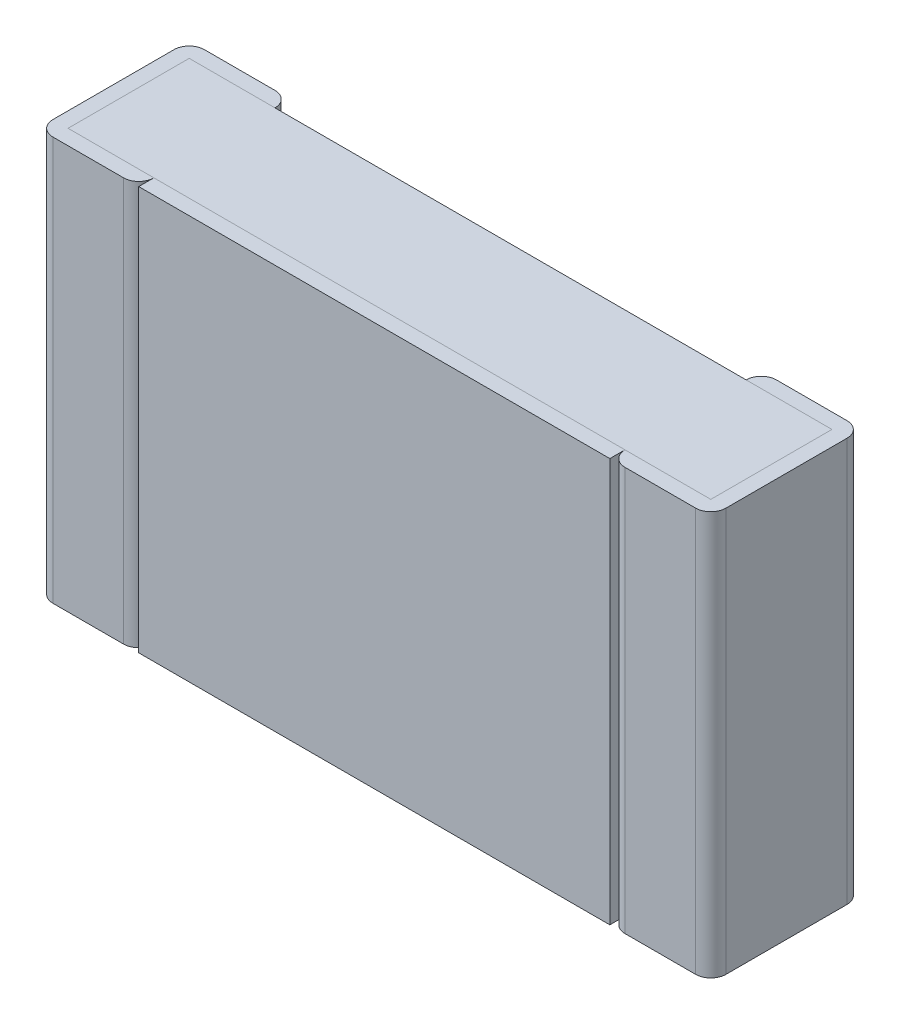
ISO-10303-21;
HEADER;
FILE_DESCRIPTION(('STEP AP214'),'2;1');
FILE_NAME('part.step','',(''),(''),'','','');
FILE_SCHEMA(('AUTOMOTIVE_DESIGN { 1 0 10303 214 1 1 1 1 }'));
ENDSEC;
DATA;
#1=APPLICATION_CONTEXT('core data for automotive mechanical design processes');
#2=APPLICATION_PROTOCOL_DEFINITION('international standard','automotive_design',2000,#1);
#3=PRODUCT_CONTEXT('',#1,'mechanical');
#4=PRODUCT('Part','Part','',(#3));
#5=PRODUCT_RELATED_PRODUCT_CATEGORY('part','',(#4));
#6=PRODUCT_DEFINITION_FORMATION('','',#4);
#7=PRODUCT_DEFINITION_CONTEXT('part definition',#1,'design');
#8=PRODUCT_DEFINITION('design','',#6,#7);
#9=PRODUCT_DEFINITION_SHAPE('','',#8);
#10=(LENGTH_UNIT() NAMED_UNIT(*) SI_UNIT(.MILLI.,.METRE.));
#11=(NAMED_UNIT(*) PLANE_ANGLE_UNIT() SI_UNIT($,.RADIAN.));
#12=(NAMED_UNIT(*) SI_UNIT($,.STERADIAN.) SOLID_ANGLE_UNIT());
#13=UNCERTAINTY_MEASURE_WITH_UNIT(LENGTH_MEASURE(1.E-05),#10,'distance_accuracy_value','');
#14=(GEOMETRIC_REPRESENTATION_CONTEXT(3) GLOBAL_UNCERTAINTY_ASSIGNED_CONTEXT((#13)) GLOBAL_UNIT_ASSIGNED_CONTEXT((#10,
#11,#12)) REPRESENTATION_CONTEXT('',''));
#15=CARTESIAN_POINT('',(0.,0.,0.));
#16=DIRECTION('',(0.,0.,1.));
#17=DIRECTION('',(1.,0.,0.));
#18=AXIS2_PLACEMENT_3D('',#15,#16,#17);
#19=CARTESIAN_POINT('',(-1.,-0.6,0.));
#20=DIRECTION('',(1.,0.,0.));
#21=DIRECTION('',(0.,1.,0.));
#22=AXIS2_PLACEMENT_3D('',#19,#20,#21);
#23=PLANE('',#22);
#24=DIRECTION('',(0.,1.,0.));
#25=VECTOR('',#24,1.);
#26=CARTESIAN_POINT('',(-1.,-0.6,0.405));
#27=LINE('',#26,#25);
#28=CARTESIAN_POINT('',(-1.,-0.6,0.405));
#29=VERTEX_POINT('',#28);
#30=CARTESIAN_POINT('',(-1.,0.6,0.405));
#31=VERTEX_POINT('',#30);
#32=EDGE_CURVE('E11',#29,#31,#27,.T.);
#33=ORIENTED_EDGE('',*,*,#32,.T.);
#34=DIRECTION('',(0.,0.,1.));
#35=VECTOR('',#34,1.);
#36=CARTESIAN_POINT('',(-1.,0.6,0.));
#37=LINE('',#36,#35);
#38=CARTESIAN_POINT('',(-1.,0.6,0.045));
#39=VERTEX_POINT('',#38);
#40=EDGE_CURVE('E41',#39,#31,#37,.T.);
#41=ORIENTED_EDGE('',*,*,#40,.F.);
#42=DIRECTION('',(0.,1.,0.));
#43=VECTOR('',#42,1.);
#44=CARTESIAN_POINT('',(-1.,-0.6,0.045));
#45=LINE('',#44,#43);
#46=CARTESIAN_POINT('',(-1.,-0.6,0.045));
#47=VERTEX_POINT('',#46);
#48=EDGE_CURVE('E225',#47,#39,#45,.T.);
#49=ORIENTED_EDGE('',*,*,#48,.F.);
#50=DIRECTION('',(0.,0.,1.));
#51=VECTOR('',#50,1.);
#52=CARTESIAN_POINT('',(-1.,-0.6,0.));
#53=LINE('',#52,#51);
#54=EDGE_CURVE('E27',#47,#29,#53,.T.);
#55=ORIENTED_EDGE('',*,*,#54,.T.);
#56=EDGE_LOOP('',(#33,#41,#49,#55));
#57=FACE_BOUND('',#56,.T.);
#58=ADVANCED_FACE('F16',(#57),#23,.F.);
#59=CARTESIAN_POINT('',(-1.,-0.6,0.));
#60=DIRECTION('',(0.,1.,0.));
#61=DIRECTION('',(1.,0.,0.));
#62=AXIS2_PLACEMENT_3D('',#59,#60,#61);
#63=PLANE('',#62);
#64=CARTESIAN_POINT('',(-0.745,-0.6,0.045));
#65=DIRECTION('',(0.,1.,0.));
#66=DIRECTION('',(0.,0.,1.));
#67=AXIS2_PLACEMENT_3D('',#64,#65,#66);
#68=CIRCLE('',#67,0.045);
#69=CARTESIAN_POINT('',(-0.7,-0.6,0.045));
#70=VERTEX_POINT('',#69);
#71=CARTESIAN_POINT('',(-0.745,-0.6,0.));
#72=VERTEX_POINT('',#71);
#73=EDGE_CURVE('E316',#70,#72,#68,.T.);
#74=ORIENTED_EDGE('',*,*,#73,.F.);
#75=DIRECTION('',(1.,0.,0.));
#76=VECTOR('',#75,1.);
#77=CARTESIAN_POINT('',(-0.955,-0.6,0.045));
#78=LINE('',#77,#76);
#79=CARTESIAN_POINT('',(-0.955,-0.6,0.045));
#80=VERTEX_POINT('',#79);
#81=EDGE_CURVE('E205',#80,#70,#78,.T.);
#82=ORIENTED_EDGE('',*,*,#81,.F.);
#83=DIRECTION('',(0.,0.,1.));
#84=VECTOR('',#83,1.);
#85=CARTESIAN_POINT('',(-0.955,-0.6,0.045));
#86=LINE('',#85,#84);
#87=CARTESIAN_POINT('',(-0.955,-0.6,0.405));
#88=VERTEX_POINT('',#87);
#89=EDGE_CURVE('E189',#80,#88,#86,.T.);
#90=ORIENTED_EDGE('',*,*,#89,.T.);
#91=DIRECTION('',(1.,0.,0.));
#92=VECTOR('',#91,1.);
#93=CARTESIAN_POINT('',(-0.955,-0.6,0.405));
#94=LINE('',#93,#92);
#95=CARTESIAN_POINT('',(-0.7,-0.6,0.405));
#96=VERTEX_POINT('',#95);
#97=EDGE_CURVE('E315',#88,#96,#94,.T.);
#98=ORIENTED_EDGE('',*,*,#97,.T.);
#99=CARTESIAN_POINT('',(-0.745,-0.6,0.405));
#100=DIRECTION('',(0.,-1.,0.));
#101=DIRECTION('',(0.,0.,1.));
#102=AXIS2_PLACEMENT_3D('',#99,#100,#101);
#103=CIRCLE('',#102,0.045);
#104=CARTESIAN_POINT('',(-0.745,-0.6,0.45));
#105=VERTEX_POINT('',#104);
#106=EDGE_CURVE('E194',#96,#105,#103,.T.);
#107=ORIENTED_EDGE('',*,*,#106,.T.);
#108=DIRECTION('',(1.,0.,0.));
#109=VECTOR('',#108,1.);
#110=CARTESIAN_POINT('',(-1.,-0.6,0.45));
#111=LINE('',#110,#109);
#112=CARTESIAN_POINT('',(-0.955,-0.6,0.45));
#113=VERTEX_POINT('',#112);
#114=EDGE_CURVE('E209',#113,#105,#111,.T.);
#115=ORIENTED_EDGE('',*,*,#114,.F.);
#116=CARTESIAN_POINT('',(-0.955,-0.6,0.405));
#117=DIRECTION('',(0.,1.,0.));
#118=DIRECTION('',(0.,0.,1.));
#119=AXIS2_PLACEMENT_3D('',#116,#117,#118);
#120=CIRCLE('',#119,0.045);
#121=EDGE_CURVE('E173',#29,#113,#120,.T.);
#122=ORIENTED_EDGE('',*,*,#121,.F.);
#123=ORIENTED_EDGE('',*,*,#54,.F.);
#124=CARTESIAN_POINT('',(-0.955,-0.6,0.045));
#125=DIRECTION('',(0.,-1.,0.));
#126=DIRECTION('',(0.,0.,1.));
#127=AXIS2_PLACEMENT_3D('',#124,#125,#126);
#128=CIRCLE('',#127,0.045);
#129=CARTESIAN_POINT('',(-0.955,-0.6,0.));
#130=VERTEX_POINT('',#129);
#131=EDGE_CURVE('E190',#47,#130,#128,.T.);
#132=ORIENTED_EDGE('',*,*,#131,.T.);
#133=DIRECTION('',(1.,0.,0.));
#134=VECTOR('',#133,1.);
#135=CARTESIAN_POINT('',(-1.,-0.6,0.));
#136=LINE('',#135,#134);
#137=EDGE_CURVE('E195',#130,#72,#136,.T.);
#138=ORIENTED_EDGE('',*,*,#137,.T.);
#139=EDGE_LOOP('',(#74,#82,#90,#98,#107,#115,#122,#123,#132,#138));
#140=FACE_BOUND('',#139,.T.);
#141=ADVANCED_FACE('F18',(#140),#63,.F.);
#142=CARTESIAN_POINT('',(-0.955,-0.6,0.045));
#143=DIRECTION('',(0.,1.,0.));
#144=DIRECTION('',(-1.,0.,0.));
#145=AXIS2_PLACEMENT_3D('',#142,#143,#144);
#146=CYLINDRICAL_SURFACE('',#145,0.045);
#147=ORIENTED_EDGE('',*,*,#48,.T.);
#148=CARTESIAN_POINT('',(-0.955,0.6,0.045));
#149=DIRECTION('',(0.,-1.,0.));
#150=DIRECTION('',(0.,0.,1.));
#151=AXIS2_PLACEMENT_3D('',#148,#149,#150);
#152=CIRCLE('',#151,0.045);
#153=CARTESIAN_POINT('',(-0.955,0.6,0.));
#154=VERTEX_POINT('',#153);
#155=EDGE_CURVE('E218',#39,#154,#152,.T.);
#156=ORIENTED_EDGE('',*,*,#155,.T.);
#157=DIRECTION('',(0.,1.,0.));
#158=VECTOR('',#157,1.);
#159=CARTESIAN_POINT('',(-0.955,-0.6,0.));
#160=LINE('',#159,#158);
#161=EDGE_CURVE('E341',#130,#154,#160,.T.);
#162=ORIENTED_EDGE('',*,*,#161,.F.);
#163=ORIENTED_EDGE('',*,*,#131,.F.);
#164=EDGE_LOOP('',(#147,#156,#162,#163));
#165=FACE_BOUND('',#164,.T.);
#166=ADVANCED_FACE('F526',(#165),#146,.T.);
#167=CARTESIAN_POINT('',(-0.955,-0.6,0.405));
#168=DIRECTION('',(0.,1.,0.));
#169=DIRECTION('',(-1.,0.,0.));
#170=AXIS2_PLACEMENT_3D('',#167,#168,#169);
#171=CYLINDRICAL_SURFACE('',#170,0.045);
#172=ORIENTED_EDGE('',*,*,#121,.T.);
#173=DIRECTION('',(0.,1.,0.));
#174=VECTOR('',#173,1.);
#175=CARTESIAN_POINT('',(-0.955,-0.6,0.45));
#176=LINE('',#175,#174);
#177=CARTESIAN_POINT('',(-0.955,0.6,0.45));
#178=VERTEX_POINT('',#177);
#179=EDGE_CURVE('E169',#113,#178,#176,.T.);
#180=ORIENTED_EDGE('',*,*,#179,.T.);
#181=CARTESIAN_POINT('',(-0.955,0.6,0.405));
#182=DIRECTION('',(0.,1.,0.));
#183=DIRECTION('',(0.,0.,1.));
#184=AXIS2_PLACEMENT_3D('',#181,#182,#183);
#185=CIRCLE('',#184,0.045);
#186=EDGE_CURVE('E166',#31,#178,#185,.T.);
#187=ORIENTED_EDGE('',*,*,#186,.F.);
#188=ORIENTED_EDGE('',*,*,#32,.F.);
#189=EDGE_LOOP('',(#172,#180,#187,#188));
#190=FACE_BOUND('',#189,.T.);
#191=ADVANCED_FACE('F516',(#190),#171,.T.);
#192=CARTESIAN_POINT('',(-1.,0.6,0.));
#193=DIRECTION('',(0.,1.,0.));
#194=DIRECTION('',(1.,0.,0.));
#195=AXIS2_PLACEMENT_3D('',#192,#193,#194);
#196=PLANE('',#195);
#197=DIRECTION('',(1.,0.,0.));
#198=VECTOR('',#197,1.);
#199=CARTESIAN_POINT('',(-1.,0.6,0.));
#200=LINE('',#199,#198);
#201=CARTESIAN_POINT('',(-0.745,0.6,0.));
#202=VERTEX_POINT('',#201);
#203=EDGE_CURVE('E318',#154,#202,#200,.T.);
#204=ORIENTED_EDGE('',*,*,#203,.F.);
#205=ORIENTED_EDGE('',*,*,#155,.F.);
#206=ORIENTED_EDGE('',*,*,#40,.T.);
#207=ORIENTED_EDGE('',*,*,#186,.T.);
#208=DIRECTION('',(1.,0.,0.));
#209=VECTOR('',#208,1.);
#210=CARTESIAN_POINT('',(-1.,0.6,0.45));
#211=LINE('',#210,#209);
#212=CARTESIAN_POINT('',(-0.745,0.6,0.45));
#213=VERTEX_POINT('',#212);
#214=EDGE_CURVE('E168',#178,#213,#211,.T.);
#215=ORIENTED_EDGE('',*,*,#214,.T.);
#216=CARTESIAN_POINT('',(-0.745,0.6,0.405));
#217=DIRECTION('',(0.,-1.,0.));
#218=DIRECTION('',(0.,0.,1.));
#219=AXIS2_PLACEMENT_3D('',#216,#217,#218);
#220=CIRCLE('',#219,0.045);
#221=CARTESIAN_POINT('',(-0.7,0.6,0.405));
#222=VERTEX_POINT('',#221);
#223=EDGE_CURVE('E263',#222,#213,#220,.T.);
#224=ORIENTED_EDGE('',*,*,#223,.F.);
#225=DIRECTION('',(1.,0.,0.));
#226=VECTOR('',#225,1.);
#227=CARTESIAN_POINT('',(-0.955,0.6,0.405));
#228=LINE('',#227,#226);
#229=CARTESIAN_POINT('',(-0.955,0.6,0.405));
#230=VERTEX_POINT('',#229);
#231=EDGE_CURVE('E255',#230,#222,#228,.T.);
#232=ORIENTED_EDGE('',*,*,#231,.F.);
#233=DIRECTION('',(0.,0.,1.));
#234=VECTOR('',#233,1.);
#235=CARTESIAN_POINT('',(-0.955,0.6,0.045));
#236=LINE('',#235,#234);
#237=CARTESIAN_POINT('',(-0.955,0.6,0.045));
#238=VERTEX_POINT('',#237);
#239=EDGE_CURVE('E259',#238,#230,#236,.T.);
#240=ORIENTED_EDGE('',*,*,#239,.F.);
#241=DIRECTION('',(1.,0.,0.));
#242=VECTOR('',#241,1.);
#243=CARTESIAN_POINT('',(-0.955,0.6,0.045));
#244=LINE('',#243,#242);
#245=CARTESIAN_POINT('',(-0.7,0.6,0.045));
#246=VERTEX_POINT('',#245);
#247=EDGE_CURVE('E254',#238,#246,#244,.T.);
#248=ORIENTED_EDGE('',*,*,#247,.T.);
#249=CARTESIAN_POINT('',(-0.745,0.6,0.045));
#250=DIRECTION('',(0.,1.,0.));
#251=DIRECTION('',(0.,0.,1.));
#252=AXIS2_PLACEMENT_3D('',#249,#250,#251);
#253=CIRCLE('',#252,0.045);
#254=EDGE_CURVE('E345',#246,#202,#253,.T.);
#255=ORIENTED_EDGE('',*,*,#254,.T.);
#256=EDGE_LOOP('',(#204,#205,#206,#207,#215,#224,#232,#240,#248,#255));
#257=FACE_BOUND('',#256,.T.);
#258=ADVANCED_FACE('F489',(#257),#196,.T.);
#259=CARTESIAN_POINT('',(-1.,-0.6,0.));
#260=DIRECTION('',(0.,0.,1.));
#261=DIRECTION('',(1.,0.,0.));
#262=AXIS2_PLACEMENT_3D('',#259,#260,#261);
#263=PLANE('',#262);
#264=DIRECTION('',(0.,1.,0.));
#265=VECTOR('',#264,1.);
#266=CARTESIAN_POINT('',(-0.745,-0.6,0.));
#267=LINE('',#266,#265);
#268=EDGE_CURVE('E319',#72,#202,#267,.T.);
#269=ORIENTED_EDGE('',*,*,#268,.F.);
#270=ORIENTED_EDGE('',*,*,#137,.F.);
#271=ORIENTED_EDGE('',*,*,#161,.T.);
#272=ORIENTED_EDGE('',*,*,#203,.T.);
#273=EDGE_LOOP('',(#269,#270,#271,#272));
#274=FACE_BOUND('',#273,.T.);
#275=ADVANCED_FACE('F506',(#274),#263,.F.);
#276=CARTESIAN_POINT('',(-0.745,-0.6,0.045));
#277=DIRECTION('',(0.,1.,0.));
#278=DIRECTION('',(1.,0.,0.));
#279=AXIS2_PLACEMENT_3D('',#276,#277,#278);
#280=CYLINDRICAL_SURFACE('',#279,0.045);
#281=ORIENTED_EDGE('',*,*,#73,.T.);
#282=ORIENTED_EDGE('',*,*,#268,.T.);
#283=ORIENTED_EDGE('',*,*,#254,.F.);
#284=DIRECTION('',(0.,1.,0.));
#285=VECTOR('',#284,1.);
#286=CARTESIAN_POINT('',(-0.7,-0.6,0.045));
#287=LINE('',#286,#285);
#288=EDGE_CURVE('E174',#70,#246,#287,.T.);
#289=ORIENTED_EDGE('',*,*,#288,.F.);
#290=EDGE_LOOP('',(#281,#282,#283,#289));
#291=FACE_BOUND('',#290,.T.);
#292=ADVANCED_FACE('F488',(#291),#280,.T.);
#293=CARTESIAN_POINT('',(-0.955,-0.6,0.045));
#294=DIRECTION('',(0.,1.,0.));
#295=DIRECTION('',(1.,0.,0.));
#296=AXIS2_PLACEMENT_3D('',#293,#294,#295);
#297=PLANE('',#296);
#298=DIRECTION('',(1.,0.,0.));
#299=VECTOR('',#298,1.);
#300=CARTESIAN_POINT('',(-0.955,-0.6,0.045));
#301=LINE('',#300,#299);
#302=CARTESIAN_POINT('',(0.7,-0.6,0.045));
#303=VERTEX_POINT('',#302);
#304=EDGE_CURVE('E184',#70,#303,#301,.T.);
#305=ORIENTED_EDGE('',*,*,#304,.T.);
#306=DIRECTION('',(1.,0.,0.));
#307=VECTOR('',#306,1.);
#308=CARTESIAN_POINT('',(-0.955,-0.6,0.045));
#309=LINE('',#308,#307);
#310=CARTESIAN_POINT('',(0.955,-0.6,0.045));
#311=VERTEX_POINT('',#310);
#312=EDGE_CURVE('E180',#303,#311,#309,.T.);
#313=ORIENTED_EDGE('',*,*,#312,.T.);
#314=DIRECTION('',(0.,0.,1.));
#315=VECTOR('',#314,1.);
#316=CARTESIAN_POINT('',(0.955,-0.6,0.045));
#317=LINE('',#316,#315);
#318=CARTESIAN_POINT('',(0.955,-0.6,0.405));
#319=VERTEX_POINT('',#318);
#320=EDGE_CURVE('E185',#311,#319,#317,.T.);
#321=ORIENTED_EDGE('',*,*,#320,.T.);
#322=DIRECTION('',(1.,0.,0.));
#323=VECTOR('',#322,1.);
#324=CARTESIAN_POINT('',(-0.955,-0.6,0.405));
#325=LINE('',#324,#323);
#326=CARTESIAN_POINT('',(0.7,-0.6,0.405));
#327=VERTEX_POINT('',#326);
#328=EDGE_CURVE('E305',#327,#319,#325,.T.);
#329=ORIENTED_EDGE('',*,*,#328,.F.);
#330=DIRECTION('',(1.,0.,0.));
#331=VECTOR('',#330,1.);
#332=CARTESIAN_POINT('',(-0.7,-0.6,0.405));
#333=LINE('',#332,#331);
#334=EDGE_CURVE('E233',#96,#327,#333,.T.);
#335=ORIENTED_EDGE('',*,*,#334,.F.);
#336=ORIENTED_EDGE('',*,*,#97,.F.);
#337=ORIENTED_EDGE('',*,*,#89,.F.);
#338=ORIENTED_EDGE('',*,*,#81,.T.);
#339=EDGE_LOOP('',(#305,#313,#321,#329,#335,#336,#337,#338));
#340=FACE_BOUND('',#339,.T.);
#341=ADVANCED_FACE('F502',(#340),#297,.F.);
#342=CARTESIAN_POINT('',(-1.,-0.6,0.45));
#343=DIRECTION('',(0.,0.,1.));
#344=DIRECTION('',(1.,0.,0.));
#345=AXIS2_PLACEMENT_3D('',#342,#343,#344);
#346=PLANE('',#345);
#347=ORIENTED_EDGE('',*,*,#214,.F.);
#348=ORIENTED_EDGE('',*,*,#179,.F.);
#349=ORIENTED_EDGE('',*,*,#114,.T.);
#350=DIRECTION('',(0.,1.,0.));
#351=VECTOR('',#350,1.);
#352=CARTESIAN_POINT('',(-0.745,-0.6,0.45));
#353=LINE('',#352,#351);
#354=EDGE_CURVE('E238',#105,#213,#353,.T.);
#355=ORIENTED_EDGE('',*,*,#354,.T.);
#356=EDGE_LOOP('',(#347,#348,#349,#355));
#357=FACE_BOUND('',#356,.T.);
#358=ADVANCED_FACE('F538',(#357),#346,.T.);
#359=CARTESIAN_POINT('',(-0.745,-0.6,0.405));
#360=DIRECTION('',(0.,1.,0.));
#361=DIRECTION('',(1.,0.,0.));
#362=AXIS2_PLACEMENT_3D('',#359,#360,#361);
#363=CYLINDRICAL_SURFACE('',#362,0.045);
#364=DIRECTION('',(0.,1.,0.));
#365=VECTOR('',#364,1.);
#366=CARTESIAN_POINT('',(-0.7,-0.6,0.405));
#367=LINE('',#366,#365);
#368=EDGE_CURVE('E266',#96,#222,#367,.T.);
#369=ORIENTED_EDGE('',*,*,#368,.T.);
#370=ORIENTED_EDGE('',*,*,#223,.T.);
#371=ORIENTED_EDGE('',*,*,#354,.F.);
#372=ORIENTED_EDGE('',*,*,#106,.F.);
#373=EDGE_LOOP('',(#369,#370,#371,#372));
#374=FACE_BOUND('',#373,.T.);
#375=ADVANCED_FACE('F541',(#374),#363,.T.);
#376=CARTESIAN_POINT('',(-0.955,0.6,0.045));
#377=DIRECTION('',(0.,1.,0.));
#378=DIRECTION('',(1.,0.,0.));
#379=AXIS2_PLACEMENT_3D('',#376,#377,#378);
#380=PLANE('',#379);
#381=ORIENTED_EDGE('',*,*,#247,.F.);
#382=ORIENTED_EDGE('',*,*,#239,.T.);
#383=ORIENTED_EDGE('',*,*,#231,.T.);
#384=DIRECTION('',(1.,0.,0.));
#385=VECTOR('',#384,1.);
#386=CARTESIAN_POINT('',(-0.7,0.6,0.405));
#387=LINE('',#386,#385);
#388=CARTESIAN_POINT('',(0.7,0.6,0.405));
#389=VERTEX_POINT('',#388);
#390=EDGE_CURVE('E214',#222,#389,#387,.T.);
#391=ORIENTED_EDGE('',*,*,#390,.T.);
#392=DIRECTION('',(1.,0.,0.));
#393=VECTOR('',#392,1.);
#394=CARTESIAN_POINT('',(-0.955,0.6,0.405));
#395=LINE('',#394,#393);
#396=CARTESIAN_POINT('',(0.955,0.6,0.405));
#397=VERTEX_POINT('',#396);
#398=EDGE_CURVE('E210',#389,#397,#395,.T.);
#399=ORIENTED_EDGE('',*,*,#398,.T.);
#400=DIRECTION('',(0.,0.,1.));
#401=VECTOR('',#400,1.);
#402=CARTESIAN_POINT('',(0.955,0.6,0.045));
#403=LINE('',#402,#401);
#404=CARTESIAN_POINT('',(0.955,0.6,0.045));
#405=VERTEX_POINT('',#404);
#406=EDGE_CURVE('E230',#405,#397,#403,.T.);
#407=ORIENTED_EDGE('',*,*,#406,.F.);
#408=DIRECTION('',(1.,0.,0.));
#409=VECTOR('',#408,1.);
#410=CARTESIAN_POINT('',(-0.955,0.6,0.045));
#411=LINE('',#410,#409);
#412=CARTESIAN_POINT('',(0.7,0.6,0.045));
#413=VERTEX_POINT('',#412);
#414=EDGE_CURVE('E284',#413,#405,#411,.T.);
#415=ORIENTED_EDGE('',*,*,#414,.F.);
#416=DIRECTION('',(1.,0.,0.));
#417=VECTOR('',#416,1.);
#418=CARTESIAN_POINT('',(-0.955,0.6,0.045));
#419=LINE('',#418,#417);
#420=EDGE_CURVE('E178',#246,#413,#419,.T.);
#421=ORIENTED_EDGE('',*,*,#420,.F.);
#422=EDGE_LOOP('',(#381,#382,#383,#391,#399,#407,#415,#421));
#423=FACE_BOUND('',#422,.T.);
#424=ADVANCED_FACE('F376',(#423),#380,.T.);
#425=CARTESIAN_POINT('',(-0.955,-0.6,0.045));
#426=DIRECTION('',(0.,0.,1.));
#427=DIRECTION('',(1.,0.,0.));
#428=AXIS2_PLACEMENT_3D('',#425,#426,#427);
#429=PLANE('',#428);
#430=ORIENTED_EDGE('',*,*,#420,.T.);
#431=DIRECTION('',(0.,1.,0.));
#432=VECTOR('',#431,1.);
#433=CARTESIAN_POINT('',(0.7,-0.6,0.045));
#434=LINE('',#433,#432);
#435=EDGE_CURVE('E149',#303,#413,#434,.T.);
#436=ORIENTED_EDGE('',*,*,#435,.F.);
#437=ORIENTED_EDGE('',*,*,#304,.F.);
#438=ORIENTED_EDGE('',*,*,#288,.T.);
#439=EDGE_LOOP('',(#430,#436,#437,#438));
#440=FACE_BOUND('',#439,.T.);
#441=ADVANCED_FACE('F485',(#440),#429,.F.);
#442=CARTESIAN_POINT('',(0.7,-0.6,0.));
#443=DIRECTION('',(0.,1.,0.));
#444=DIRECTION('',(1.,0.,0.));
#445=AXIS2_PLACEMENT_3D('',#442,#443,#444);
#446=PLANE('',#445);
#447=CARTESIAN_POINT('',(0.955,-0.6,0.045));
#448=DIRECTION('',(0.,1.,0.));
#449=DIRECTION('',(0.,0.,1.));
#450=AXIS2_PLACEMENT_3D('',#447,#448,#449);
#451=CIRCLE('',#450,0.045);
#452=CARTESIAN_POINT('',(1.,-0.6,0.045));
#453=VERTEX_POINT('',#452);
#454=CARTESIAN_POINT('',(0.955,-0.6,0.));
#455=VERTEX_POINT('',#454);
#456=EDGE_CURVE('E250',#453,#455,#451,.T.);
#457=ORIENTED_EDGE('',*,*,#456,.F.);
#458=DIRECTION('',(0.,0.,1.));
#459=VECTOR('',#458,1.);
#460=CARTESIAN_POINT('',(1.,-0.6,0.));
#461=LINE('',#460,#459);
#462=CARTESIAN_POINT('',(1.,-0.6,0.405));
#463=VERTEX_POINT('',#462);
#464=EDGE_CURVE('E179',#453,#463,#461,.T.);
#465=ORIENTED_EDGE('',*,*,#464,.T.);
#466=CARTESIAN_POINT('',(0.955,-0.6,0.405));
#467=DIRECTION('',(0.,-1.,0.));
#468=DIRECTION('',(0.,0.,1.));
#469=AXIS2_PLACEMENT_3D('',#466,#467,#468);
#470=CIRCLE('',#469,0.045);
#471=CARTESIAN_POINT('',(0.955,-0.6,0.45));
#472=VERTEX_POINT('',#471);
#473=EDGE_CURVE('E270',#463,#472,#470,.T.);
#474=ORIENTED_EDGE('',*,*,#473,.T.);
#475=DIRECTION('',(1.,0.,0.));
#476=VECTOR('',#475,1.);
#477=CARTESIAN_POINT('',(0.7,-0.6,0.45));
#478=LINE('',#477,#476);
#479=CARTESIAN_POINT('',(0.745,-0.6,0.45));
#480=VERTEX_POINT('',#479);
#481=EDGE_CURVE('E274',#480,#472,#478,.T.);
#482=ORIENTED_EDGE('',*,*,#481,.F.);
#483=CARTESIAN_POINT('',(0.745,-0.6,0.405));
#484=DIRECTION('',(0.,1.,0.));
#485=DIRECTION('',(0.,0.,1.));
#486=AXIS2_PLACEMENT_3D('',#483,#484,#485);
#487=CIRCLE('',#486,0.045);
#488=EDGE_CURVE('E239',#327,#480,#487,.T.);
#489=ORIENTED_EDGE('',*,*,#488,.F.);
#490=ORIENTED_EDGE('',*,*,#328,.T.);
#491=ORIENTED_EDGE('',*,*,#320,.F.);
#492=ORIENTED_EDGE('',*,*,#312,.F.);
#493=CARTESIAN_POINT('',(0.745,-0.6,0.045));
#494=DIRECTION('',(0.,-1.,0.));
#495=DIRECTION('',(0.,0.,1.));
#496=AXIS2_PLACEMENT_3D('',#493,#494,#495);
#497=CIRCLE('',#496,0.045);
#498=CARTESIAN_POINT('',(0.745,-0.6,0.));
#499=VERTEX_POINT('',#498);
#500=EDGE_CURVE('E200',#303,#499,#497,.T.);
#501=ORIENTED_EDGE('',*,*,#500,.T.);
#502=DIRECTION('',(1.,0.,0.));
#503=VECTOR('',#502,1.);
#504=CARTESIAN_POINT('',(0.7,-0.6,0.));
#505=LINE('',#504,#503);
#506=EDGE_CURVE('E196',#499,#455,#505,.T.);
#507=ORIENTED_EDGE('',*,*,#506,.T.);
#508=EDGE_LOOP('',(#457,#465,#474,#482,#489,#490,#491,#492,#501,#507));
#509=FACE_BOUND('',#508,.T.);
#510=ADVANCED_FACE('F500',(#509),#446,.F.);
#511=CARTESIAN_POINT('',(-0.7,-0.6,0.405));
#512=DIRECTION('',(0.,1.,0.));
#513=DIRECTION('',(1.,0.,0.));
#514=AXIS2_PLACEMENT_3D('',#511,#512,#513);
#515=PLANE('',#514);
#516=DIRECTION('',(0.,0.,1.));
#517=VECTOR('',#516,1.);
#518=CARTESIAN_POINT('',(0.7,-0.6,0.405));
#519=LINE('',#518,#517);
#520=CARTESIAN_POINT('',(0.7,-0.6,0.45));
#521=VERTEX_POINT('',#520);
#522=EDGE_CURVE('E201',#327,#521,#519,.T.);
#523=ORIENTED_EDGE('',*,*,#522,.T.);
#524=DIRECTION('',(1.,0.,0.));
#525=VECTOR('',#524,1.);
#526=CARTESIAN_POINT('',(-0.7,-0.6,0.45));
#527=LINE('',#526,#525);
#528=CARTESIAN_POINT('',(-0.7,-0.6,0.45));
#529=VERTEX_POINT('',#528);
#530=EDGE_CURVE('E137',#529,#521,#527,.T.);
#531=ORIENTED_EDGE('',*,*,#530,.F.);
#532=DIRECTION('',(0.,0.,1.));
#533=VECTOR('',#532,1.);
#534=CARTESIAN_POINT('',(-0.7,-0.6,0.405));
#535=LINE('',#534,#533);
#536=EDGE_CURVE('E288',#96,#529,#535,.T.);
#537=ORIENTED_EDGE('',*,*,#536,.F.);
#538=ORIENTED_EDGE('',*,*,#334,.T.);
#539=EDGE_LOOP('',(#523,#531,#537,#538));
#540=FACE_BOUND('',#539,.T.);
#541=ADVANCED_FACE('F555',(#540),#515,.F.);
#542=CARTESIAN_POINT('',(-0.7,-0.6,0.405));
#543=DIRECTION('',(1.,0.,0.));
#544=DIRECTION('',(0.,1.,0.));
#545=AXIS2_PLACEMENT_3D('',#542,#543,#544);
#546=PLANE('',#545);
#547=DIRECTION('',(0.,1.,0.));
#548=VECTOR('',#547,1.);
#549=CARTESIAN_POINT('',(-0.7,-0.6,0.45));
#550=LINE('',#549,#548);
#551=CARTESIAN_POINT('',(-0.7,0.6,0.45));
#552=VERTEX_POINT('',#551);
#553=EDGE_CURVE('E297',#529,#552,#550,.T.);
#554=ORIENTED_EDGE('',*,*,#553,.T.);
#555=DIRECTION('',(0.,0.,1.));
#556=VECTOR('',#555,1.);
#557=CARTESIAN_POINT('',(-0.7,0.6,0.405));
#558=LINE('',#557,#556);
#559=EDGE_CURVE('E144',#222,#552,#558,.T.);
#560=ORIENTED_EDGE('',*,*,#559,.F.);
#561=ORIENTED_EDGE('',*,*,#368,.F.);
#562=ORIENTED_EDGE('',*,*,#536,.T.);
#563=EDGE_LOOP('',(#554,#560,#561,#562));
#564=FACE_BOUND('',#563,.T.);
#565=ADVANCED_FACE('F557',(#564),#546,.F.);
#566=CARTESIAN_POINT('',(0.7,0.6,0.));
#567=DIRECTION('',(0.,1.,0.));
#568=DIRECTION('',(1.,0.,0.));
#569=AXIS2_PLACEMENT_3D('',#566,#567,#568);
#570=PLANE('',#569);
#571=DIRECTION('',(1.,0.,0.));
#572=VECTOR('',#571,1.);
#573=CARTESIAN_POINT('',(0.7,0.6,0.));
#574=LINE('',#573,#572);
#575=CARTESIAN_POINT('',(0.745,0.6,0.));
#576=VERTEX_POINT('',#575);
#577=CARTESIAN_POINT('',(0.955,0.6,0.));
#578=VERTEX_POINT('',#577);
#579=EDGE_CURVE('E115',#576,#578,#574,.T.);
#580=ORIENTED_EDGE('',*,*,#579,.F.);
#581=CARTESIAN_POINT('',(0.745,0.6,0.045));
#582=DIRECTION('',(0.,-1.,0.));
#583=DIRECTION('',(0.,0.,1.));
#584=AXIS2_PLACEMENT_3D('',#581,#582,#583);
#585=CIRCLE('',#584,0.045);
#586=EDGE_CURVE('E203',#413,#576,#585,.T.);
#587=ORIENTED_EDGE('',*,*,#586,.F.);
#588=ORIENTED_EDGE('',*,*,#414,.T.);
#589=ORIENTED_EDGE('',*,*,#406,.T.);
#590=ORIENTED_EDGE('',*,*,#398,.F.);
#591=CARTESIAN_POINT('',(0.745,0.6,0.405));
#592=DIRECTION('',(0.,1.,0.));
#593=DIRECTION('',(0.,0.,1.));
#594=AXIS2_PLACEMENT_3D('',#591,#592,#593);
#595=CIRCLE('',#594,0.045);
#596=CARTESIAN_POINT('',(0.745,0.6,0.45));
#597=VERTEX_POINT('',#596);
#598=EDGE_CURVE('E226',#389,#597,#595,.T.);
#599=ORIENTED_EDGE('',*,*,#598,.T.);
#600=DIRECTION('',(1.,0.,0.));
#601=VECTOR('',#600,1.);
#602=CARTESIAN_POINT('',(0.7,0.6,0.45));
#603=LINE('',#602,#601);
#604=CARTESIAN_POINT('',(0.955,0.6,0.45));
#605=VERTEX_POINT('',#604);
#606=EDGE_CURVE('E231',#597,#605,#603,.T.);
#607=ORIENTED_EDGE('',*,*,#606,.T.);
#608=CARTESIAN_POINT('',(0.955,0.6,0.405));
#609=DIRECTION('',(0.,-1.,0.));
#610=DIRECTION('',(0.,0.,1.));
#611=AXIS2_PLACEMENT_3D('',#608,#609,#610);
#612=CIRCLE('',#611,0.045);
#613=CARTESIAN_POINT('',(1.,0.6,0.405));
#614=VERTEX_POINT('',#613);
#615=EDGE_CURVE('E292',#614,#605,#612,.T.);
#616=ORIENTED_EDGE('',*,*,#615,.F.);
#617=DIRECTION('',(0.,0.,1.));
#618=VECTOR('',#617,1.);
#619=CARTESIAN_POINT('',(1.,0.6,0.));
#620=LINE('',#619,#618);
#621=CARTESIAN_POINT('',(1.,0.6,0.045));
#622=VERTEX_POINT('',#621);
#623=EDGE_CURVE('E330',#622,#614,#620,.T.);
#624=ORIENTED_EDGE('',*,*,#623,.F.);
#625=CARTESIAN_POINT('',(0.955,0.6,0.045));
#626=DIRECTION('',(0.,1.,0.));
#627=DIRECTION('',(0.,0.,1.));
#628=AXIS2_PLACEMENT_3D('',#625,#626,#627);
#629=CIRCLE('',#628,0.045);
#630=EDGE_CURVE('E221',#622,#578,#629,.T.);
#631=ORIENTED_EDGE('',*,*,#630,.T.);
#632=EDGE_LOOP('',(#580,#587,#588,#589,#590,#599,#607,#616,#624,#631));
#633=FACE_BOUND('',#632,.T.);
#634=ADVANCED_FACE('F492',(#633),#570,.T.);
#635=CARTESIAN_POINT('',(-0.7,0.6,0.405));
#636=DIRECTION('',(0.,1.,0.));
#637=DIRECTION('',(1.,0.,0.));
#638=AXIS2_PLACEMENT_3D('',#635,#636,#637);
#639=PLANE('',#638);
#640=ORIENTED_EDGE('',*,*,#390,.F.);
#641=ORIENTED_EDGE('',*,*,#559,.T.);
#642=DIRECTION('',(1.,0.,0.));
#643=VECTOR('',#642,1.);
#644=CARTESIAN_POINT('',(-0.7,0.6,0.45));
#645=LINE('',#644,#643);
#646=CARTESIAN_POINT('',(0.7,0.6,0.45));
#647=VERTEX_POINT('',#646);
#648=EDGE_CURVE('E141',#552,#647,#645,.T.);
#649=ORIENTED_EDGE('',*,*,#648,.T.);
#650=DIRECTION('',(0.,0.,1.));
#651=VECTOR('',#650,1.);
#652=CARTESIAN_POINT('',(0.7,0.6,0.405));
#653=LINE('',#652,#651);
#654=EDGE_CURVE('E124',#389,#647,#653,.T.);
#655=ORIENTED_EDGE('',*,*,#654,.F.);
#656=EDGE_LOOP('',(#640,#641,#649,#655));
#657=FACE_BOUND('',#656,.T.);
#658=ADVANCED_FACE('F142',(#657),#639,.T.);
#659=CARTESIAN_POINT('',(0.745,-0.6,0.045));
#660=DIRECTION('',(0.,1.,0.));
#661=DIRECTION('',(-1.,0.,0.));
#662=AXIS2_PLACEMENT_3D('',#659,#660,#661);
#663=CYLINDRICAL_SURFACE('',#662,0.045);
#664=ORIENTED_EDGE('',*,*,#435,.T.);
#665=ORIENTED_EDGE('',*,*,#586,.T.);
#666=DIRECTION('',(0.,1.,0.));
#667=VECTOR('',#666,1.);
#668=CARTESIAN_POINT('',(0.745,-0.6,0.));
#669=LINE('',#668,#667);
#670=EDGE_CURVE('E247',#499,#576,#669,.T.);
#671=ORIENTED_EDGE('',*,*,#670,.F.);
#672=ORIENTED_EDGE('',*,*,#500,.F.);
#673=EDGE_LOOP('',(#664,#665,#671,#672));
#674=FACE_BOUND('',#673,.T.);
#675=ADVANCED_FACE('F495',(#674),#663,.T.);
#676=CARTESIAN_POINT('',(0.7,-0.6,0.));
#677=DIRECTION('',(0.,0.,1.));
#678=DIRECTION('',(1.,0.,0.));
#679=AXIS2_PLACEMENT_3D('',#676,#677,#678);
#680=PLANE('',#679);
#681=DIRECTION('',(0.,1.,0.));
#682=VECTOR('',#681,1.);
#683=CARTESIAN_POINT('',(0.955,-0.6,0.));
#684=LINE('',#683,#682);
#685=EDGE_CURVE('E337',#455,#578,#684,.T.);
#686=ORIENTED_EDGE('',*,*,#685,.F.);
#687=ORIENTED_EDGE('',*,*,#506,.F.);
#688=ORIENTED_EDGE('',*,*,#670,.T.);
#689=ORIENTED_EDGE('',*,*,#579,.T.);
#690=EDGE_LOOP('',(#686,#687,#688,#689));
#691=FACE_BOUND('',#690,.T.);
#692=ADVANCED_FACE('F497',(#691),#680,.F.);
#693=CARTESIAN_POINT('',(0.955,-0.6,0.045));
#694=DIRECTION('',(0.,1.,0.));
#695=DIRECTION('',(1.,0.,0.));
#696=AXIS2_PLACEMENT_3D('',#693,#694,#695);
#697=CYLINDRICAL_SURFACE('',#696,0.045);
#698=ORIENTED_EDGE('',*,*,#456,.T.);
#699=ORIENTED_EDGE('',*,*,#685,.T.);
#700=ORIENTED_EDGE('',*,*,#630,.F.);
#701=DIRECTION('',(0.,1.,0.));
#702=VECTOR('',#701,1.);
#703=CARTESIAN_POINT('',(1.,-0.6,0.045));
#704=LINE('',#703,#702);
#705=EDGE_CURVE('E164',#453,#622,#704,.T.);
#706=ORIENTED_EDGE('',*,*,#705,.F.);
#707=EDGE_LOOP('',(#698,#699,#700,#706));
#708=FACE_BOUND('',#707,.T.);
#709=ADVANCED_FACE('F582',(#708),#697,.T.);
#710=CARTESIAN_POINT('',(1.,-0.6,0.));
#711=DIRECTION('',(1.,0.,0.));
#712=DIRECTION('',(0.,1.,0.));
#713=AXIS2_PLACEMENT_3D('',#710,#711,#712);
#714=PLANE('',#713);
#715=ORIENTED_EDGE('',*,*,#464,.F.);
#716=ORIENTED_EDGE('',*,*,#705,.T.);
#717=ORIENTED_EDGE('',*,*,#623,.T.);
#718=DIRECTION('',(0.,1.,0.));
#719=VECTOR('',#718,1.);
#720=CARTESIAN_POINT('',(1.,-0.6,0.405));
#721=LINE('',#720,#719);
#722=EDGE_CURVE('E296',#463,#614,#721,.T.);
#723=ORIENTED_EDGE('',*,*,#722,.F.);
#724=EDGE_LOOP('',(#715,#716,#717,#723));
#725=FACE_BOUND('',#724,.T.);
#726=ADVANCED_FACE('F536',(#725),#714,.T.);
#727=CARTESIAN_POINT('',(0.955,-0.6,0.405));
#728=DIRECTION('',(0.,1.,0.));
#729=DIRECTION('',(1.,0.,0.));
#730=AXIS2_PLACEMENT_3D('',#727,#728,#729);
#731=CYLINDRICAL_SURFACE('',#730,0.045);
#732=ORIENTED_EDGE('',*,*,#722,.T.);
#733=ORIENTED_EDGE('',*,*,#615,.T.);
#734=DIRECTION('',(0.,1.,0.));
#735=VECTOR('',#734,1.);
#736=CARTESIAN_POINT('',(0.955,-0.6,0.45));
#737=LINE('',#736,#735);
#738=EDGE_CURVE('E242',#472,#605,#737,.T.);
#739=ORIENTED_EDGE('',*,*,#738,.F.);
#740=ORIENTED_EDGE('',*,*,#473,.F.);
#741=EDGE_LOOP('',(#732,#733,#739,#740));
#742=FACE_BOUND('',#741,.T.);
#743=ADVANCED_FACE('F532',(#742),#731,.T.);
#744=CARTESIAN_POINT('',(0.7,-0.6,0.45));
#745=DIRECTION('',(0.,0.,1.));
#746=DIRECTION('',(1.,0.,0.));
#747=AXIS2_PLACEMENT_3D('',#744,#745,#746);
#748=PLANE('',#747);
#749=ORIENTED_EDGE('',*,*,#606,.F.);
#750=DIRECTION('',(0.,1.,0.));
#751=VECTOR('',#750,1.);
#752=CARTESIAN_POINT('',(0.745,-0.6,0.45));
#753=LINE('',#752,#751);
#754=EDGE_CURVE('E243',#480,#597,#753,.T.);
#755=ORIENTED_EDGE('',*,*,#754,.F.);
#756=ORIENTED_EDGE('',*,*,#481,.T.);
#757=ORIENTED_EDGE('',*,*,#738,.T.);
#758=EDGE_LOOP('',(#749,#755,#756,#757));
#759=FACE_BOUND('',#758,.T.);
#760=ADVANCED_FACE('F535',(#759),#748,.T.);
#761=CARTESIAN_POINT('',(0.745,-0.6,0.405));
#762=DIRECTION('',(0.,1.,0.));
#763=DIRECTION('',(-1.,0.,0.));
#764=AXIS2_PLACEMENT_3D('',#761,#762,#763);
#765=CYLINDRICAL_SURFACE('',#764,0.045);
#766=ORIENTED_EDGE('',*,*,#488,.T.);
#767=ORIENTED_EDGE('',*,*,#754,.T.);
#768=ORIENTED_EDGE('',*,*,#598,.F.);
#769=DIRECTION('',(0.,1.,0.));
#770=VECTOR('',#769,1.);
#771=CARTESIAN_POINT('',(0.7,-0.6,0.405));
#772=LINE('',#771,#770);
#773=EDGE_CURVE('E20',#327,#389,#772,.T.);
#774=ORIENTED_EDGE('',*,*,#773,.F.);
#775=EDGE_LOOP('',(#766,#767,#768,#774));
#776=FACE_BOUND('',#775,.T.);
#777=ADVANCED_FACE('F546',(#776),#765,.T.);
#778=CARTESIAN_POINT('',(0.7,-0.6,0.405));
#779=DIRECTION('',(1.,0.,0.));
#780=DIRECTION('',(0.,1.,0.));
#781=AXIS2_PLACEMENT_3D('',#778,#779,#780);
#782=PLANE('',#781);
#783=ORIENTED_EDGE('',*,*,#522,.F.);
#784=ORIENTED_EDGE('',*,*,#773,.T.);
#785=ORIENTED_EDGE('',*,*,#654,.T.);
#786=DIRECTION('',(0.,1.,0.));
#787=VECTOR('',#786,1.);
#788=CARTESIAN_POINT('',(0.7,-0.6,0.45));
#789=LINE('',#788,#787);
#790=EDGE_CURVE('E130',#521,#647,#789,.T.);
#791=ORIENTED_EDGE('',*,*,#790,.F.);
#792=EDGE_LOOP('',(#783,#784,#785,#791));
#793=FACE_BOUND('',#792,.T.);
#794=ADVANCED_FACE('F127',(#793),#782,.T.);
#795=CARTESIAN_POINT('',(-0.7,-0.6,0.45));
#796=DIRECTION('',(0.,0.,1.));
#797=DIRECTION('',(1.,0.,0.));
#798=AXIS2_PLACEMENT_3D('',#795,#796,#797);
#799=PLANE('',#798);
#800=ORIENTED_EDGE('',*,*,#553,.F.);
#801=ORIENTED_EDGE('',*,*,#530,.T.);
#802=ORIENTED_EDGE('',*,*,#790,.T.);
#803=ORIENTED_EDGE('',*,*,#648,.F.);
#804=EDGE_LOOP('',(#800,#801,#802,#803));
#805=FACE_BOUND('',#804,.T.);
#806=ADVANCED_FACE('F152',(#805),#799,.T.);
#807=CLOSED_SHELL('',(#58,#141,#166,#191,#258,#275,#292,#341,#358,#375,#424,#441,#510,#541,#565,
#634,#658,#675,#692,#709,#726,#743,#760,#777,#794,#806));
#808=MANIFOLD_SOLID_BREP('B1',#807);
#809=ADVANCED_BREP_SHAPE_REPRESENTATION('',(#18,#808),#14);
#810=SHAPE_DEFINITION_REPRESENTATION(#9,#809);
ENDSEC;
END-ISO-10303-21;
